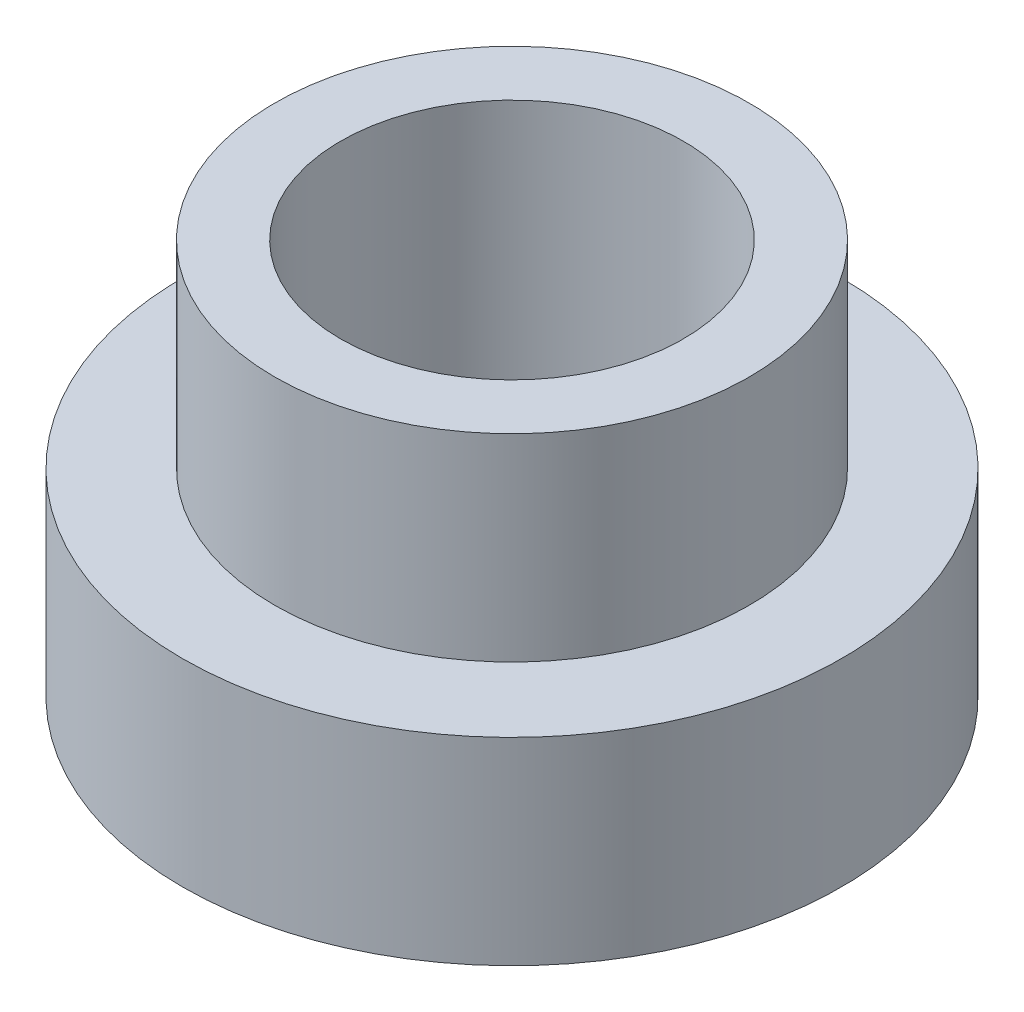
ISO-10303-21;
HEADER;
FILE_DESCRIPTION(('STEP AP214'),'2;1');
FILE_NAME('part.step','',(''),(''),'','','');
FILE_SCHEMA(('AUTOMOTIVE_DESIGN { 1 0 10303 214 1 1 1 1 }'));
ENDSEC;
DATA;
#1=APPLICATION_CONTEXT('core data for automotive mechanical design processes');
#2=APPLICATION_PROTOCOL_DEFINITION('international standard','automotive_design',2000,#1);
#3=PRODUCT_CONTEXT('',#1,'mechanical');
#4=PRODUCT('Part','Part','',(#3));
#5=PRODUCT_RELATED_PRODUCT_CATEGORY('part','',(#4));
#6=PRODUCT_DEFINITION_FORMATION('','',#4);
#7=PRODUCT_DEFINITION_CONTEXT('part definition',#1,'design');
#8=PRODUCT_DEFINITION('design','',#6,#7);
#9=PRODUCT_DEFINITION_SHAPE('','',#8);
#10=(LENGTH_UNIT() NAMED_UNIT(*) SI_UNIT(.MILLI.,.METRE.));
#11=(NAMED_UNIT(*) PLANE_ANGLE_UNIT() SI_UNIT($,.RADIAN.));
#12=(NAMED_UNIT(*) SI_UNIT($,.STERADIAN.) SOLID_ANGLE_UNIT());
#13=UNCERTAINTY_MEASURE_WITH_UNIT(LENGTH_MEASURE(1.E-05),#10,'distance_accuracy_value','');
#14=(GEOMETRIC_REPRESENTATION_CONTEXT(3) GLOBAL_UNCERTAINTY_ASSIGNED_CONTEXT((#13)) GLOBAL_UNIT_ASSIGNED_CONTEXT((#10,
#11,#12)) REPRESENTATION_CONTEXT('',''));
#15=CARTESIAN_POINT('',(0.,0.,0.));
#16=DIRECTION('',(0.,0.,1.));
#17=DIRECTION('',(1.,0.,0.));
#18=AXIS2_PLACEMENT_3D('',#15,#16,#17);
#19=CARTESIAN_POINT('',(0.,3.,0.));
#20=DIRECTION('',(0.,-1.,0.));
#21=DIRECTION('',(0.,0.,-1.));
#22=AXIS2_PLACEMENT_3D('',#19,#20,#21);
#23=CYLINDRICAL_SURFACE('',#22,5.);
#24=CARTESIAN_POINT('',(0.,3.,0.));
#25=DIRECTION('',(0.,1.,0.));
#26=DIRECTION('',(0.,0.,1.));
#27=AXIS2_PLACEMENT_3D('',#24,#25,#26);
#28=CIRCLE('',#27,5.);
#29=CARTESIAN_POINT('',(0.,3.,5.));
#30=VERTEX_POINT('',#29);
#31=EDGE_CURVE('E45',#30,#30,#28,.T.);
#32=ORIENTED_EDGE('',*,*,#31,.F.);
#33=EDGE_LOOP('',(#32));
#34=FACE_BOUND('',#33,.T.);
#35=CARTESIAN_POINT('',(0.,0.,0.));
#36=DIRECTION('',(0.,1.,0.));
#37=DIRECTION('',(0.,0.,1.));
#38=AXIS2_PLACEMENT_3D('',#35,#36,#37);
#39=CIRCLE('',#38,5.);
#40=CARTESIAN_POINT('',(0.,0.,5.));
#41=VERTEX_POINT('',#40);
#42=EDGE_CURVE('E40',#41,#41,#39,.T.);
#43=ORIENTED_EDGE('',*,*,#42,.T.);
#44=EDGE_LOOP('',(#43));
#45=FACE_BOUND('',#44,.T.);
#46=ADVANCED_FACE('F37',(#34,#45),#23,.T.);
#47=CARTESIAN_POINT('',(0.,3.,0.));
#48=DIRECTION('',(0.,1.,0.));
#49=DIRECTION('',(0.,0.,1.));
#50=AXIS2_PLACEMENT_3D('',#47,#48,#49);
#51=PLANE('',#50);
#52=CARTESIAN_POINT('',(0.,3.,0.));
#53=DIRECTION('',(0.,1.,0.));
#54=DIRECTION('',(0.,0.,1.));
#55=AXIS2_PLACEMENT_3D('',#52,#53,#54);
#56=CIRCLE('',#55,3.6);
#57=CARTESIAN_POINT('',(0.,3.,3.6));
#58=VERTEX_POINT('',#57);
#59=EDGE_CURVE('E10',#58,#58,#56,.T.);
#60=ORIENTED_EDGE('',*,*,#59,.F.);
#61=EDGE_LOOP('',(#60));
#62=FACE_BOUND('',#61,.T.);
#63=ORIENTED_EDGE('',*,*,#31,.T.);
#64=EDGE_LOOP('',(#63));
#65=FACE_BOUND('',#64,.T.);
#66=ADVANCED_FACE('F81',(#62,#65),#51,.T.);
#67=CARTESIAN_POINT('',(0.,0.,0.));
#68=DIRECTION('',(0.,1.,0.));
#69=DIRECTION('',(0.,0.,1.));
#70=AXIS2_PLACEMENT_3D('',#67,#68,#69);
#71=PLANE('',#70);
#72=CARTESIAN_POINT('',(0.,0.,0.));
#73=DIRECTION('',(0.,1.,0.));
#74=DIRECTION('',(0.,0.,1.));
#75=AXIS2_PLACEMENT_3D('',#72,#73,#74);
#76=CIRCLE('',#75,2.6);
#77=CARTESIAN_POINT('',(0.,0.,2.6));
#78=VERTEX_POINT('',#77);
#79=EDGE_CURVE('E57',#78,#78,#76,.T.);
#80=ORIENTED_EDGE('',*,*,#79,.T.);
#81=EDGE_LOOP('',(#80));
#82=FACE_BOUND('',#81,.T.);
#83=ORIENTED_EDGE('',*,*,#42,.F.);
#84=EDGE_LOOP('',(#83));
#85=FACE_BOUND('',#84,.T.);
#86=ADVANCED_FACE('F76',(#82,#85),#71,.F.);
#87=CARTESIAN_POINT('',(0.,6.,0.));
#88=DIRECTION('',(0.,-1.,0.));
#89=DIRECTION('',(0.,0.,-1.));
#90=AXIS2_PLACEMENT_3D('',#87,#88,#89);
#91=CYLINDRICAL_SURFACE('',#90,3.6);
#92=CARTESIAN_POINT('',(0.,6.,0.));
#93=DIRECTION('',(0.,1.,0.));
#94=DIRECTION('',(0.,0.,1.));
#95=AXIS2_PLACEMENT_3D('',#92,#93,#94);
#96=CIRCLE('',#95,3.6);
#97=CARTESIAN_POINT('',(0.,6.,3.6));
#98=VERTEX_POINT('',#97);
#99=EDGE_CURVE('E52',#98,#98,#96,.T.);
#100=ORIENTED_EDGE('',*,*,#99,.F.);
#101=EDGE_LOOP('',(#100));
#102=FACE_BOUND('',#101,.T.);
#103=ORIENTED_EDGE('',*,*,#59,.T.);
#104=EDGE_LOOP('',(#103));
#105=FACE_BOUND('',#104,.T.);
#106=ADVANCED_FACE('F71',(#102,#105),#91,.T.);
#107=CARTESIAN_POINT('',(0.,6.,0.));
#108=DIRECTION('',(0.,1.,0.));
#109=DIRECTION('',(0.,0.,1.));
#110=AXIS2_PLACEMENT_3D('',#107,#108,#109);
#111=PLANE('',#110);
#112=CARTESIAN_POINT('',(0.,6.,0.));
#113=DIRECTION('',(0.,1.,0.));
#114=DIRECTION('',(0.,0.,1.));
#115=AXIS2_PLACEMENT_3D('',#112,#113,#114);
#116=CIRCLE('',#115,2.6);
#117=CARTESIAN_POINT('',(0.,6.,2.6));
#118=VERTEX_POINT('',#117);
#119=EDGE_CURVE('E56',#118,#118,#116,.T.);
#120=ORIENTED_EDGE('',*,*,#119,.F.);
#121=EDGE_LOOP('',(#120));
#122=FACE_BOUND('',#121,.T.);
#123=ORIENTED_EDGE('',*,*,#99,.T.);
#124=EDGE_LOOP('',(#123));
#125=FACE_BOUND('',#124,.T.);
#126=ADVANCED_FACE('F68',(#122,#125),#111,.T.);
#127=CARTESIAN_POINT('',(0.,6.,0.));
#128=DIRECTION('',(0.,-1.,0.));
#129=DIRECTION('',(0.,0.,-1.));
#130=AXIS2_PLACEMENT_3D('',#127,#128,#129);
#131=CYLINDRICAL_SURFACE('',#130,2.6);
#132=ORIENTED_EDGE('',*,*,#119,.T.);
#133=EDGE_LOOP('',(#132));
#134=FACE_BOUND('',#133,.T.);
#135=ORIENTED_EDGE('',*,*,#79,.F.);
#136=EDGE_LOOP('',(#135));
#137=FACE_BOUND('',#136,.T.);
#138=ADVANCED_FACE('F65',(#134,#137),#131,.F.);
#139=CLOSED_SHELL('',(#46,#66,#86,#106,#126,#138));
#140=MANIFOLD_SOLID_BREP('B2',#139);
#141=ADVANCED_BREP_SHAPE_REPRESENTATION('',(#18,#140),#14);
#142=SHAPE_DEFINITION_REPRESENTATION(#9,#141);
ENDSEC;
END-ISO-10303-21;
